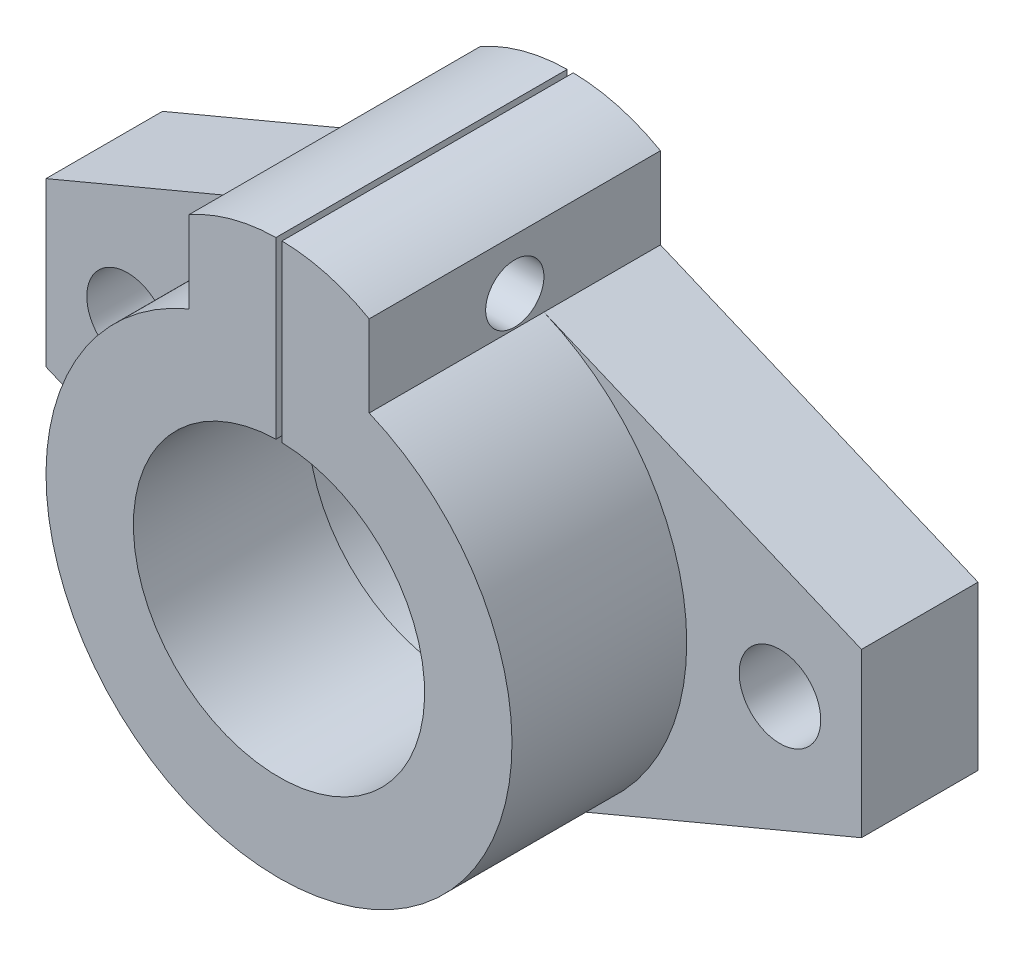
ISO-10303-21;
HEADER;
FILE_DESCRIPTION(('STEP AP214'),'2;1');
FILE_NAME('part.step','',(''),(''),'','','');
FILE_SCHEMA(('AUTOMOTIVE_DESIGN { 1 0 10303 214 1 1 1 1 }'));
ENDSEC;
DATA;
#1=APPLICATION_CONTEXT('core data for automotive mechanical design processes');
#2=APPLICATION_PROTOCOL_DEFINITION('international standard','automotive_design',2000,#1);
#3=PRODUCT_CONTEXT('',#1,'mechanical');
#4=PRODUCT('Part','Part','',(#3));
#5=PRODUCT_RELATED_PRODUCT_CATEGORY('part','',(#4));
#6=PRODUCT_DEFINITION_FORMATION('','',#4);
#7=PRODUCT_DEFINITION_CONTEXT('part definition',#1,'design');
#8=PRODUCT_DEFINITION('design','',#6,#7);
#9=PRODUCT_DEFINITION_SHAPE('','',#8);
#10=(LENGTH_UNIT() NAMED_UNIT(*) SI_UNIT(.MILLI.,.METRE.));
#11=(NAMED_UNIT(*) PLANE_ANGLE_UNIT() SI_UNIT($,.RADIAN.));
#12=(NAMED_UNIT(*) SI_UNIT($,.STERADIAN.) SOLID_ANGLE_UNIT());
#13=UNCERTAINTY_MEASURE_WITH_UNIT(LENGTH_MEASURE(1.E-05),#10,'distance_accuracy_value','');
#14=(GEOMETRIC_REPRESENTATION_CONTEXT(3) GLOBAL_UNCERTAINTY_ASSIGNED_CONTEXT((#13)) GLOBAL_UNIT_ASSIGNED_CONTEXT((#10,
#11,#12)) REPRESENTATION_CONTEXT('',''));
#15=CARTESIAN_POINT('',(0.,0.,0.));
#16=DIRECTION('',(0.,0.,1.));
#17=DIRECTION('',(1.,0.,0.));
#18=AXIS2_PLACEMENT_3D('',#15,#16,#17);
#19=CARTESIAN_POINT('',(0.,11.87489743787,10.));
#20=DIRECTION('',(0.,0.,-1.));
#21=DIRECTION('',(-1.,0.,0.));
#22=AXIS2_PLACEMENT_3D('',#19,#20,#21);
#23=CYLINDRICAL_SURFACE('',#22,15.6193467136848);
#24=DIRECTION('',(0.,0.,-1.));
#25=VECTOR('',#24,1.);
#26=CARTESIAN_POINT('',(-0.258597553957538,27.4921033040735,10.));
#27=LINE('',#26,#25);
#28=CARTESIAN_POINT('',(-0.258597553957538,27.4921033040735,0.));
#29=VERTEX_POINT('',#28);
#30=CARTESIAN_POINT('',(-0.258597553957538,27.4921033040735,25.));
#31=VERTEX_POINT('',#30);
#32=EDGE_CURVE('E179',#29,#31,#27,.F.);
#33=ORIENTED_EDGE('',*,*,#32,.F.);
#34=CARTESIAN_POINT('',(0.,11.87489743787,0.));
#35=DIRECTION('',(0.,0.,1.));
#36=DIRECTION('',(1.,0.,0.));
#37=AXIS2_PLACEMENT_3D('',#34,#35,#36);
#38=CIRCLE('',#37,15.6193467136848);
#39=CARTESIAN_POINT('',(-7.74027571439312,25.441478570472,0.));
#40=VERTEX_POINT('',#39);
#41=EDGE_CURVE('E276',#40,#29,#38,.F.);
#42=ORIENTED_EDGE('',*,*,#41,.F.);
#43=DIRECTION('',(0.,0.,-1.));
#44=VECTOR('',#43,1.);
#45=CARTESIAN_POINT('',(-7.74027571439312,25.441478570472,10.));
#46=LINE('',#45,#44);
#47=CARTESIAN_POINT('',(-7.74027571439312,25.441478570472,25.));
#48=VERTEX_POINT('',#47);
#49=EDGE_CURVE('E246',#48,#40,#46,.T.);
#50=ORIENTED_EDGE('',*,*,#49,.F.);
#51=CARTESIAN_POINT('',(0.,11.8748974378699,25.));
#52=DIRECTION('',(0.,0.,1.));
#53=DIRECTION('',(-1.,0.,0.));
#54=AXIS2_PLACEMENT_3D('',#51,#52,#53);
#55=CIRCLE('',#54,15.6193467136848);
#56=EDGE_CURVE('E188',#31,#48,#55,.T.);
#57=ORIENTED_EDGE('',*,*,#56,.F.);
#58=EDGE_LOOP('',(#33,#42,#50,#57));
#59=FACE_BOUND('',#58,.T.);
#60=ADVANCED_FACE('F36',(#59),#23,.T.);
#61=CARTESIAN_POINT('',(0.,0.,10.));
#62=DIRECTION('',(0.,0.,1.));
#63=DIRECTION('',(1.,0.,0.));
#64=AXIS2_PLACEMENT_3D('',#61,#62,#63);
#65=PLANE('',#64);
#66=CARTESIAN_POINT('',(0.,0.,10.));
#67=DIRECTION('',(0.,0.,1.));
#68=DIRECTION('',(1.,0.,0.));
#69=AXIS2_PLACEMENT_3D('',#66,#67,#68);
#70=CIRCLE('',#69,20.);
#71=CARTESIAN_POINT('',(-7.74027571439312,18.441478570472,10.));
#72=VERTEX_POINT('',#71);
#73=CARTESIAN_POINT('',(-7.74027571439311,-18.441478570472,10.));
#74=VERTEX_POINT('',#73);
#75=EDGE_CURVE('E173',#72,#74,#70,.T.);
#76=ORIENTED_EDGE('',*,*,#75,.F.);
#77=DIRECTION('',(0.922073928523597,0.387013785719656,0.));
#78=VECTOR('',#77,1.);
#79=CARTESIAN_POINT('',(-7.74027571439313,18.441478570472,10.));
#80=LINE('',#79,#78);
#81=CARTESIAN_POINT('',(-35.0000000000568,7.00000000013542,10.));
#82=VERTEX_POINT('',#81);
#83=EDGE_CURVE('E316',#82,#72,#80,.T.);
#84=ORIENTED_EDGE('',*,*,#83,.F.);
#85=DIRECTION('',(0.,1.,0.));
#86=VECTOR('',#85,1.);
#87=CARTESIAN_POINT('',(-35.0000000000568,0.,10.));
#88=LINE('',#87,#86);
#89=CARTESIAN_POINT('',(-35.0000000000568,-7.00000000013543,10.));
#90=VERTEX_POINT('',#89);
#91=EDGE_CURVE('E224',#90,#82,#88,.T.);
#92=ORIENTED_EDGE('',*,*,#91,.F.);
#93=DIRECTION('',(0.922073928523598,-0.387013785719656,0.));
#94=VECTOR('',#93,1.);
#95=CARTESIAN_POINT('',(-7.74027571439311,-18.441478570472,10.));
#96=LINE('',#95,#94);
#97=EDGE_CURVE('E220',#90,#74,#96,.T.);
#98=ORIENTED_EDGE('',*,*,#97,.T.);
#99=EDGE_LOOP('',(#76,#84,#92,#98));
#100=FACE_BOUND('',#99,.T.);
#101=CARTESIAN_POINT('',(-28.,0.,10.));
#102=DIRECTION('',(0.,0.,1.));
#103=DIRECTION('',(1.,0.,0.));
#104=AXIS2_PLACEMENT_3D('',#101,#102,#103);
#105=CIRCLE('',#104,3.5);
#106=CARTESIAN_POINT('',(-24.5,0.,10.));
#107=VERTEX_POINT('',#106);
#108=EDGE_CURVE('E274',#107,#107,#105,.T.);
#109=ORIENTED_EDGE('',*,*,#108,.F.);
#110=EDGE_LOOP('',(#109));
#111=FACE_BOUND('',#110,.T.);
#112=ADVANCED_FACE('F394',(#100,#111),#65,.T.);
#113=CARTESIAN_POINT('',(7.74027571439313,18.441478570472,10.));
#114=DIRECTION('',(-0.387013785719656,-0.922073928523597,0.));
#115=DIRECTION('',(0.922073928523597,-0.387013785719656,0.));
#116=AXIS2_PLACEMENT_3D('',#113,#114,#115);
#117=PLANE('',#116);
#118=DIRECTION('',(-0.922073928523597,0.387013785719656,0.));
#119=VECTOR('',#118,1.);
#120=CARTESIAN_POINT('',(7.74027571439313,18.441478570472,0.));
#121=LINE('',#120,#119);
#122=CARTESIAN_POINT('',(35.0000000000568,7.00000000013542,0.));
#123=VERTEX_POINT('',#122);
#124=CARTESIAN_POINT('',(7.74027571439312,18.441478570472,0.));
#125=VERTEX_POINT('',#124);
#126=EDGE_CURVE('E263',#123,#125,#121,.T.);
#127=ORIENTED_EDGE('',*,*,#126,.T.);
#128=DIRECTION('',(0.,0.,-1.));
#129=VECTOR('',#128,1.);
#130=CARTESIAN_POINT('',(7.74027571439312,18.441478570472,10.));
#131=LINE('',#130,#129);
#132=CARTESIAN_POINT('',(7.74027571439312,18.441478570472,10.));
#133=VERTEX_POINT('',#132);
#134=EDGE_CURVE('E205',#133,#125,#131,.T.);
#135=ORIENTED_EDGE('',*,*,#134,.F.);
#136=DIRECTION('',(-0.922073928523597,0.387013785719656,0.));
#137=VECTOR('',#136,1.);
#138=CARTESIAN_POINT('',(7.74027571439313,18.441478570472,10.));
#139=LINE('',#138,#137);
#140=CARTESIAN_POINT('',(35.0000000000568,7.00000000013542,10.));
#141=VERTEX_POINT('',#140);
#142=EDGE_CURVE('E200',#141,#133,#139,.T.);
#143=ORIENTED_EDGE('',*,*,#142,.F.);
#144=DIRECTION('',(0.,0.,-1.));
#145=VECTOR('',#144,1.);
#146=CARTESIAN_POINT('',(35.0000000000568,7.00000000013542,10.));
#147=LINE('',#146,#145);
#148=EDGE_CURVE('E265',#141,#123,#147,.T.);
#149=ORIENTED_EDGE('',*,*,#148,.T.);
#150=EDGE_LOOP('',(#127,#135,#143,#149));
#151=FACE_BOUND('',#150,.T.);
#152=ADVANCED_FACE('F38',(#151),#117,.F.);
#153=CARTESIAN_POINT('',(7.74027571439312,0.,10.));
#154=DIRECTION('',(-1.,0.,0.));
#155=DIRECTION('',(0.,0.,1.));
#156=AXIS2_PLACEMENT_3D('',#153,#154,#155);
#157=PLANE('',#156);
#158=CARTESIAN_POINT('',(7.74027571439312,21.0864235760214,12.5));
#159=DIRECTION('',(1.,0.,0.));
#160=DIRECTION('',(0.,0.,-1.));
#161=AXIS2_PLACEMENT_3D('',#158,#159,#160);
#162=CIRCLE('',#161,2.5);
#163=CARTESIAN_POINT('',(7.74027571439312,21.0864235760214,10.));
#164=VERTEX_POINT('',#163);
#165=EDGE_CURVE('E374',#164,#164,#162,.T.);
#166=ORIENTED_EDGE('',*,*,#165,.F.);
#167=EDGE_LOOP('',(#166));
#168=FACE_BOUND('',#167,.T.);
#169=DIRECTION('',(0.,1.,0.));
#170=VECTOR('',#169,1.);
#171=CARTESIAN_POINT('',(7.74027571439312,0.,0.));
#172=LINE('',#171,#170);
#173=CARTESIAN_POINT('',(7.74027571439312,25.441478570472,0.));
#174=VERTEX_POINT('',#173);
#175=EDGE_CURVE('E256',#125,#174,#172,.T.);
#176=ORIENTED_EDGE('',*,*,#175,.T.);
#177=DIRECTION('',(0.,0.,-1.));
#178=VECTOR('',#177,1.);
#179=CARTESIAN_POINT('',(7.74027571439312,25.441478570472,10.));
#180=LINE('',#179,#178);
#181=CARTESIAN_POINT('',(7.74027571439312,25.441478570472,25.));
#182=VERTEX_POINT('',#181);
#183=EDGE_CURVE('E247',#182,#174,#180,.T.);
#184=ORIENTED_EDGE('',*,*,#183,.F.);
#185=DIRECTION('',(0.,1.,0.));
#186=VECTOR('',#185,1.);
#187=CARTESIAN_POINT('',(7.74027571439312,18.441478570472,25.));
#188=LINE('',#187,#186);
#189=CARTESIAN_POINT('',(7.74027571439312,18.441478570472,25.));
#190=VERTEX_POINT('',#189);
#191=EDGE_CURVE('E186',#190,#182,#188,.T.);
#192=ORIENTED_EDGE('',*,*,#191,.F.);
#193=DIRECTION('',(0.,0.,-1.));
#194=VECTOR('',#193,1.);
#195=CARTESIAN_POINT('',(7.74027571439312,18.441478570472,25.));
#196=LINE('',#195,#194);
#197=EDGE_CURVE('E195',#190,#133,#196,.T.);
#198=ORIENTED_EDGE('',*,*,#197,.T.);
#199=ORIENTED_EDGE('',*,*,#134,.T.);
#200=EDGE_LOOP('',(#176,#184,#192,#198,#199));
#201=FACE_BOUND('',#200,.T.);
#202=ADVANCED_FACE('F255',(#168,#201),#157,.F.);
#203=DIRECTION('',(0.,0.,-1.));
#204=VECTOR('',#203,1.);
#205=CARTESIAN_POINT('',(0.258597553957538,27.4921033040735,10.));
#206=LINE('',#205,#204);
#207=CARTESIAN_POINT('',(0.258597553957538,27.4921033040735,25.));
#208=VERTEX_POINT('',#207);
#209=CARTESIAN_POINT('',(0.258597553957538,27.4921033040735,0.));
#210=VERTEX_POINT('',#209);
#211=EDGE_CURVE('E360',#208,#210,#206,.T.);
#212=ORIENTED_EDGE('',*,*,#211,.F.);
#213=EDGE_CURVE('E169',#182,#208,#55,.T.);
#214=ORIENTED_EDGE('',*,*,#213,.F.);
#215=ORIENTED_EDGE('',*,*,#183,.T.);
#216=EDGE_CURVE('E269',#210,#174,#38,.F.);
#217=ORIENTED_EDGE('',*,*,#216,.F.);
#218=EDGE_LOOP('',(#212,#214,#215,#217));
#219=FACE_BOUND('',#218,.T.);
#220=ADVANCED_FACE('F396',(#219),#23,.T.);
#221=CARTESIAN_POINT('',(-7.74027571439312,0.,10.));
#222=DIRECTION('',(-1.,0.,0.));
#223=DIRECTION('',(0.,0.,1.));
#224=AXIS2_PLACEMENT_3D('',#221,#222,#223);
#225=PLANE('',#224);
#226=CARTESIAN_POINT('',(-7.74027571439312,21.0864235760214,12.5));
#227=DIRECTION('',(-1.,0.,0.));
#228=DIRECTION('',(0.,0.,1.));
#229=AXIS2_PLACEMENT_3D('',#226,#227,#228);
#230=CIRCLE('',#229,2.5);
#231=CARTESIAN_POINT('',(-7.74027571439312,21.0864235760214,15.));
#232=VERTEX_POINT('',#231);
#233=EDGE_CURVE('E170',#232,#232,#230,.T.);
#234=ORIENTED_EDGE('',*,*,#233,.F.);
#235=EDGE_LOOP('',(#234));
#236=FACE_BOUND('',#235,.T.);
#237=DIRECTION('',(0.,1.,0.));
#238=VECTOR('',#237,1.);
#239=CARTESIAN_POINT('',(-7.74027571439312,0.,0.));
#240=LINE('',#239,#238);
#241=CARTESIAN_POINT('',(-7.74027571439312,18.441478570472,0.));
#242=VERTEX_POINT('',#241);
#243=EDGE_CURVE('E279',#242,#40,#240,.T.);
#244=ORIENTED_EDGE('',*,*,#243,.F.);
#245=DIRECTION('',(0.,0.,-1.));
#246=VECTOR('',#245,1.);
#247=CARTESIAN_POINT('',(-7.74027571439312,18.441478570472,10.));
#248=LINE('',#247,#246);
#249=EDGE_CURVE('E240',#72,#242,#248,.T.);
#250=ORIENTED_EDGE('',*,*,#249,.F.);
#251=DIRECTION('',(0.,0.,-1.));
#252=VECTOR('',#251,1.);
#253=CARTESIAN_POINT('',(-7.74027571439312,18.441478570472,25.));
#254=LINE('',#253,#252);
#255=CARTESIAN_POINT('',(-7.74027571439312,18.441478570472,25.));
#256=VERTEX_POINT('',#255);
#257=EDGE_CURVE('E192',#256,#72,#254,.T.);
#258=ORIENTED_EDGE('',*,*,#257,.F.);
#259=DIRECTION('',(0.,-1.,0.));
#260=VECTOR('',#259,1.);
#261=CARTESIAN_POINT('',(-7.74027571439312,18.441478570472,25.));
#262=LINE('',#261,#260);
#263=EDGE_CURVE('E190',#48,#256,#262,.T.);
#264=ORIENTED_EDGE('',*,*,#263,.F.);
#265=ORIENTED_EDGE('',*,*,#49,.T.);
#266=EDGE_LOOP('',(#244,#250,#258,#264,#265));
#267=FACE_BOUND('',#266,.T.);
#268=ADVANCED_FACE('F345',(#236,#267),#225,.T.);
#269=CARTESIAN_POINT('',(-7.74027571439313,18.441478570472,10.));
#270=DIRECTION('',(-0.387013785719656,0.922073928523597,0.));
#271=DIRECTION('',(-0.922073928523597,-0.387013785719656,0.));
#272=AXIS2_PLACEMENT_3D('',#269,#270,#271);
#273=PLANE('',#272);
#274=DIRECTION('',(0.922073928523597,0.387013785719656,0.));
#275=VECTOR('',#274,1.);
#276=CARTESIAN_POINT('',(-7.74027571439313,18.441478570472,0.));
#277=LINE('',#276,#275);
#278=CARTESIAN_POINT('',(-35.0000000000568,7.00000000013542,0.));
#279=VERTEX_POINT('',#278);
#280=EDGE_CURVE('E282',#279,#242,#277,.T.);
#281=ORIENTED_EDGE('',*,*,#280,.F.);
#282=DIRECTION('',(0.,0.,-1.));
#283=VECTOR('',#282,1.);
#284=CARTESIAN_POINT('',(-35.0000000000568,7.00000000013542,10.));
#285=LINE('',#284,#283);
#286=EDGE_CURVE('E235',#82,#279,#285,.T.);
#287=ORIENTED_EDGE('',*,*,#286,.F.);
#288=ORIENTED_EDGE('',*,*,#83,.T.);
#289=ORIENTED_EDGE('',*,*,#249,.T.);
#290=EDGE_LOOP('',(#281,#287,#288,#289));
#291=FACE_BOUND('',#290,.T.);
#292=ADVANCED_FACE('F339',(#291),#273,.T.);
#293=CARTESIAN_POINT('',(-35.0000000000568,0.,10.));
#294=DIRECTION('',(-1.,0.,0.));
#295=DIRECTION('',(0.,0.,1.));
#296=AXIS2_PLACEMENT_3D('',#293,#294,#295);
#297=PLANE('',#296);
#298=DIRECTION('',(0.,1.,0.));
#299=VECTOR('',#298,1.);
#300=CARTESIAN_POINT('',(-35.0000000000568,0.,0.));
#301=LINE('',#300,#299);
#302=CARTESIAN_POINT('',(-35.0000000000568,-7.00000000013543,0.));
#303=VERTEX_POINT('',#302);
#304=EDGE_CURVE('E285',#303,#279,#301,.T.);
#305=ORIENTED_EDGE('',*,*,#304,.F.);
#306=DIRECTION('',(0.,0.,-1.));
#307=VECTOR('',#306,1.);
#308=CARTESIAN_POINT('',(-35.0000000000568,-7.00000000013543,10.));
#309=LINE('',#308,#307);
#310=EDGE_CURVE('E229',#90,#303,#309,.T.);
#311=ORIENTED_EDGE('',*,*,#310,.F.);
#312=ORIENTED_EDGE('',*,*,#91,.T.);
#313=ORIENTED_EDGE('',*,*,#286,.T.);
#314=EDGE_LOOP('',(#305,#311,#312,#313));
#315=FACE_BOUND('',#314,.T.);
#316=ADVANCED_FACE('F336',(#315),#297,.T.);
#317=CARTESIAN_POINT('',(-7.74027571439311,-18.441478570472,10.));
#318=DIRECTION('',(0.387013785719656,0.922073928523598,0.));
#319=DIRECTION('',(-0.922073928523598,0.387013785719656,0.));
#320=AXIS2_PLACEMENT_3D('',#317,#318,#319);
#321=PLANE('',#320);
#322=DIRECTION('',(0.922073928523598,-0.387013785719656,0.));
#323=VECTOR('',#322,1.);
#324=CARTESIAN_POINT('',(-7.74027571439311,-18.441478570472,0.));
#325=LINE('',#324,#323);
#326=CARTESIAN_POINT('',(-7.74027571439311,-18.441478570472,0.));
#327=VERTEX_POINT('',#326);
#328=EDGE_CURVE('E288',#303,#327,#325,.T.);
#329=ORIENTED_EDGE('',*,*,#328,.T.);
#330=DIRECTION('',(0.,0.,-1.));
#331=VECTOR('',#330,1.);
#332=CARTESIAN_POINT('',(-7.74027571439311,-18.441478570472,10.));
#333=LINE('',#332,#331);
#334=EDGE_CURVE('E212',#74,#327,#333,.T.);
#335=ORIENTED_EDGE('',*,*,#334,.F.);
#336=ORIENTED_EDGE('',*,*,#97,.F.);
#337=ORIENTED_EDGE('',*,*,#310,.T.);
#338=EDGE_LOOP('',(#329,#335,#336,#337));
#339=FACE_BOUND('',#338,.T.);
#340=ADVANCED_FACE('F445',(#339),#321,.F.);
#341=CARTESIAN_POINT('',(0.,0.,10.));
#342=DIRECTION('',(0.,0.,-1.));
#343=DIRECTION('',(-1.,0.,0.));
#344=AXIS2_PLACEMENT_3D('',#341,#342,#343);
#345=CYLINDRICAL_SURFACE('',#344,20.);
#346=CARTESIAN_POINT('',(0.,0.,0.));
#347=DIRECTION('',(0.,0.,1.));
#348=DIRECTION('',(1.,0.,0.));
#349=AXIS2_PLACEMENT_3D('',#346,#347,#348);
#350=CIRCLE('',#349,20.);
#351=CARTESIAN_POINT('',(7.74027571439311,-18.441478570472,0.));
#352=VERTEX_POINT('',#351);
#353=EDGE_CURVE('E290',#327,#352,#350,.T.);
#354=ORIENTED_EDGE('',*,*,#353,.T.);
#355=DIRECTION('',(0.,0.,-1.));
#356=VECTOR('',#355,1.);
#357=CARTESIAN_POINT('',(7.74027571439311,-18.441478570472,10.));
#358=LINE('',#357,#356);
#359=CARTESIAN_POINT('',(7.74027571439311,-18.441478570472,10.));
#360=VERTEX_POINT('',#359);
#361=EDGE_CURVE('E210',#360,#352,#358,.T.);
#362=ORIENTED_EDGE('',*,*,#361,.F.);
#363=EDGE_CURVE('E160',#360,#133,#70,.T.);
#364=ORIENTED_EDGE('',*,*,#363,.T.);
#365=ORIENTED_EDGE('',*,*,#197,.F.);
#366=CARTESIAN_POINT('',(0.,0.,25.));
#367=DIRECTION('',(0.,0.,1.));
#368=DIRECTION('',(1.,0.,0.));
#369=AXIS2_PLACEMENT_3D('',#366,#367,#368);
#370=CIRCLE('',#369,20.);
#371=EDGE_CURVE('E177',#256,#190,#370,.T.);
#372=ORIENTED_EDGE('',*,*,#371,.F.);
#373=ORIENTED_EDGE('',*,*,#257,.T.);
#374=ORIENTED_EDGE('',*,*,#75,.T.);
#375=ORIENTED_EDGE('',*,*,#334,.T.);
#376=EDGE_LOOP('',(#354,#362,#364,#365,#372,#373,#374,#375));
#377=FACE_BOUND('',#376,.T.);
#378=ADVANCED_FACE('F325',(#377),#345,.T.);
#379=CARTESIAN_POINT('',(7.74027571439311,-18.441478570472,10.));
#380=DIRECTION('',(0.387013785719656,-0.922073928523598,0.));
#381=DIRECTION('',(0.922073928523598,0.387013785719656,0.));
#382=AXIS2_PLACEMENT_3D('',#379,#380,#381);
#383=PLANE('',#382);
#384=DIRECTION('',(-0.922073928523598,-0.387013785719656,0.));
#385=VECTOR('',#384,1.);
#386=CARTESIAN_POINT('',(7.74027571439311,-18.441478570472,0.));
#387=LINE('',#386,#385);
#388=CARTESIAN_POINT('',(35.0000000000568,-7.00000000013543,0.));
#389=VERTEX_POINT('',#388);
#390=EDGE_CURVE('E292',#389,#352,#387,.T.);
#391=ORIENTED_EDGE('',*,*,#390,.F.);
#392=DIRECTION('',(0.,0.,-1.));
#393=VECTOR('',#392,1.);
#394=CARTESIAN_POINT('',(35.0000000000568,-7.00000000013543,10.));
#395=LINE('',#394,#393);
#396=CARTESIAN_POINT('',(35.0000000000568,-7.00000000013543,10.));
#397=VERTEX_POINT('',#396);
#398=EDGE_CURVE('E213',#397,#389,#395,.T.);
#399=ORIENTED_EDGE('',*,*,#398,.F.);
#400=DIRECTION('',(-0.922073928523598,-0.387013785719656,0.));
#401=VECTOR('',#400,1.);
#402=CARTESIAN_POINT('',(7.74027571439311,-18.441478570472,10.));
#403=LINE('',#402,#401);
#404=EDGE_CURVE('E216',#397,#360,#403,.T.);
#405=ORIENTED_EDGE('',*,*,#404,.T.);
#406=ORIENTED_EDGE('',*,*,#361,.T.);
#407=EDGE_LOOP('',(#391,#399,#405,#406));
#408=FACE_BOUND('',#407,.T.);
#409=ADVANCED_FACE('F329',(#408),#383,.T.);
#410=CARTESIAN_POINT('',(0.,0.,10.));
#411=DIRECTION('',(0.,0.,-1.));
#412=DIRECTION('',(-1.,0.,0.));
#413=AXIS2_PLACEMENT_3D('',#410,#411,#412);
#414=CYLINDRICAL_SURFACE('',#413,13.);
#415=DIRECTION('',(0.,0.,-1.));
#416=VECTOR('',#415,1.);
#417=CARTESIAN_POINT('',(-0.258597553957538,12.9974277187868,10.));
#418=LINE('',#417,#416);
#419=CARTESIAN_POINT('',(-0.258597553957538,12.9974277187868,10.));
#420=VERTEX_POINT('',#419);
#421=CARTESIAN_POINT('',(-0.258597553957538,12.9974277187868,0.));
#422=VERTEX_POINT('',#421);
#423=EDGE_CURVE('E353',#420,#422,#418,.T.);
#424=ORIENTED_EDGE('',*,*,#423,.F.);
#425=CARTESIAN_POINT('',(0.,0.,10.));
#426=DIRECTION('',(0.,0.,1.));
#427=DIRECTION('',(1.,0.,0.));
#428=AXIS2_PLACEMENT_3D('',#425,#426,#427);
#429=CIRCLE('',#428,13.);
#430=CARTESIAN_POINT('',(0.258597553957538,12.9974277187868,10.));
#431=VERTEX_POINT('',#430);
#432=EDGE_CURVE('E197',#420,#431,#429,.T.);
#433=ORIENTED_EDGE('',*,*,#432,.T.);
#434=DIRECTION('',(0.,0.,-1.));
#435=VECTOR('',#434,1.);
#436=CARTESIAN_POINT('',(0.258597553957538,12.9974277187868,10.));
#437=LINE('',#436,#435);
#438=CARTESIAN_POINT('',(0.258597553957538,12.9974277187868,0.));
#439=VERTEX_POINT('',#438);
#440=EDGE_CURVE('E365',#439,#431,#437,.F.);
#441=ORIENTED_EDGE('',*,*,#440,.F.);
#442=CARTESIAN_POINT('',(0.,0.,0.));
#443=DIRECTION('',(0.,0.,1.));
#444=DIRECTION('',(1.,0.,0.));
#445=AXIS2_PLACEMENT_3D('',#442,#443,#444);
#446=CIRCLE('',#445,13.);
#447=EDGE_CURVE('E300',#422,#439,#446,.T.);
#448=ORIENTED_EDGE('',*,*,#447,.F.);
#449=EDGE_LOOP('',(#424,#433,#441,#448));
#450=FACE_BOUND('',#449,.T.);
#451=ADVANCED_FACE('F413',(#450),#414,.F.);
#452=CARTESIAN_POINT('',(28.,0.,10.));
#453=DIRECTION('',(0.,0.,-1.));
#454=DIRECTION('',(-1.,0.,0.));
#455=AXIS2_PLACEMENT_3D('',#452,#453,#454);
#456=CYLINDRICAL_SURFACE('',#455,3.5);
#457=CARTESIAN_POINT('',(28.,0.,10.));
#458=DIRECTION('',(0.,0.,1.));
#459=DIRECTION('',(1.,0.,0.));
#460=AXIS2_PLACEMENT_3D('',#457,#458,#459);
#461=CIRCLE('',#460,3.5);
#462=CARTESIAN_POINT('',(31.5,0.,10.));
#463=VERTEX_POINT('',#462);
#464=EDGE_CURVE('E306',#463,#463,#461,.F.);
#465=ORIENTED_EDGE('',*,*,#464,.F.);
#466=EDGE_LOOP('',(#465));
#467=FACE_BOUND('',#466,.T.);
#468=CARTESIAN_POINT('',(28.,0.,0.));
#469=DIRECTION('',(0.,0.,1.));
#470=DIRECTION('',(1.,0.,0.));
#471=AXIS2_PLACEMENT_3D('',#468,#469,#470);
#472=CIRCLE('',#471,3.5);
#473=CARTESIAN_POINT('',(31.5,0.,0.));
#474=VERTEX_POINT('',#473);
#475=EDGE_CURVE('E297',#474,#474,#472,.F.);
#476=ORIENTED_EDGE('',*,*,#475,.T.);
#477=EDGE_LOOP('',(#476));
#478=FACE_BOUND('',#477,.T.);
#479=ADVANCED_FACE('F435',(#467,#478),#456,.F.);
#480=CARTESIAN_POINT('',(35.0000000000568,0.,10.));
#481=DIRECTION('',(-1.,0.,0.));
#482=DIRECTION('',(0.,0.,1.));
#483=AXIS2_PLACEMENT_3D('',#480,#481,#482);
#484=PLANE('',#483);
#485=DIRECTION('',(0.,1.,0.));
#486=VECTOR('',#485,1.);
#487=CARTESIAN_POINT('',(35.0000000000568,0.,0.));
#488=LINE('',#487,#486);
#489=EDGE_CURVE('E295',#389,#123,#488,.T.);
#490=ORIENTED_EDGE('',*,*,#489,.T.);
#491=ORIENTED_EDGE('',*,*,#148,.F.);
#492=DIRECTION('',(0.,1.,0.));
#493=VECTOR('',#492,1.);
#494=CARTESIAN_POINT('',(35.0000000000568,0.,10.));
#495=LINE('',#494,#493);
#496=EDGE_CURVE('E219',#397,#141,#495,.T.);
#497=ORIENTED_EDGE('',*,*,#496,.F.);
#498=ORIENTED_EDGE('',*,*,#398,.T.);
#499=EDGE_LOOP('',(#490,#491,#497,#498));
#500=FACE_BOUND('',#499,.T.);
#501=ADVANCED_FACE('F331',(#500),#484,.F.);
#502=CARTESIAN_POINT('',(-28.,0.,10.));
#503=DIRECTION('',(0.,0.,-1.));
#504=DIRECTION('',(-1.,0.,0.));
#505=AXIS2_PLACEMENT_3D('',#502,#503,#504);
#506=CYLINDRICAL_SURFACE('',#505,3.5);
#507=ORIENTED_EDGE('',*,*,#108,.T.);
#508=EDGE_LOOP('',(#507));
#509=FACE_BOUND('',#508,.T.);
#510=CARTESIAN_POINT('',(-28.,0.,0.));
#511=DIRECTION('',(0.,0.,1.));
#512=DIRECTION('',(1.,0.,0.));
#513=AXIS2_PLACEMENT_3D('',#510,#511,#512);
#514=CIRCLE('',#513,3.5);
#515=CARTESIAN_POINT('',(-24.5,0.,0.));
#516=VERTEX_POINT('',#515);
#517=EDGE_CURVE('E303',#516,#516,#514,.T.);
#518=ORIENTED_EDGE('',*,*,#517,.F.);
#519=EDGE_LOOP('',(#518));
#520=FACE_BOUND('',#519,.T.);
#521=ADVANCED_FACE('F427',(#509,#520),#506,.F.);
#522=ORIENTED_EDGE('',*,*,#363,.F.);
#523=ORIENTED_EDGE('',*,*,#404,.F.);
#524=ORIENTED_EDGE('',*,*,#496,.T.);
#525=ORIENTED_EDGE('',*,*,#142,.T.);
#526=EDGE_LOOP('',(#522,#523,#524,#525));
#527=FACE_BOUND('',#526,.T.);
#528=ORIENTED_EDGE('',*,*,#464,.T.);
#529=EDGE_LOOP('',(#528));
#530=FACE_BOUND('',#529,.T.);
#531=ADVANCED_FACE('F321',(#527,#530),#65,.T.);
#532=CARTESIAN_POINT('',(0.,0.,0.));
#533=DIRECTION('',(0.,0.,1.));
#534=DIRECTION('',(1.,0.,0.));
#535=AXIS2_PLACEMENT_3D('',#532,#533,#534);
#536=PLANE('',#535);
#537=ORIENTED_EDGE('',*,*,#475,.F.);
#538=EDGE_LOOP('',(#537));
#539=FACE_BOUND('',#538,.T.);
#540=ORIENTED_EDGE('',*,*,#41,.T.);
#541=DIRECTION('',(0.,-1.,0.));
#542=VECTOR('',#541,1.);
#543=CARTESIAN_POINT('',(-0.258597553957538,0.,0.));
#544=LINE('',#543,#542);
#545=EDGE_CURVE('E352',#29,#422,#544,.T.);
#546=ORIENTED_EDGE('',*,*,#545,.T.);
#547=ORIENTED_EDGE('',*,*,#447,.T.);
#548=DIRECTION('',(0.,1.,0.));
#549=VECTOR('',#548,1.);
#550=CARTESIAN_POINT('',(0.258597553957538,0.,0.));
#551=LINE('',#550,#549);
#552=EDGE_CURVE('E362',#439,#210,#551,.T.);
#553=ORIENTED_EDGE('',*,*,#552,.T.);
#554=ORIENTED_EDGE('',*,*,#216,.T.);
#555=ORIENTED_EDGE('',*,*,#175,.F.);
#556=ORIENTED_EDGE('',*,*,#126,.F.);
#557=ORIENTED_EDGE('',*,*,#489,.F.);
#558=ORIENTED_EDGE('',*,*,#390,.T.);
#559=ORIENTED_EDGE('',*,*,#353,.F.);
#560=ORIENTED_EDGE('',*,*,#328,.F.);
#561=ORIENTED_EDGE('',*,*,#304,.T.);
#562=ORIENTED_EDGE('',*,*,#280,.T.);
#563=ORIENTED_EDGE('',*,*,#243,.T.);
#564=EDGE_LOOP('',(#540,#546,#547,#553,#554,#555,#556,#557,#558,#559,#560,#561,#562,#563));
#565=FACE_BOUND('',#564,.T.);
#566=ORIENTED_EDGE('',*,*,#517,.T.);
#567=EDGE_LOOP('',(#566));
#568=FACE_BOUND('',#567,.T.);
#569=ADVANCED_FACE('F332',(#539,#565,#568),#536,.F.);
#570=CARTESIAN_POINT('',(0.,0.,25.));
#571=DIRECTION('',(0.,0.,1.));
#572=DIRECTION('',(1.,0.,0.));
#573=AXIS2_PLACEMENT_3D('',#570,#571,#572);
#574=PLANE('',#573);
#575=DIRECTION('',(0.,-1.,0.));
#576=VECTOR('',#575,1.);
#577=CARTESIAN_POINT('',(-0.258597553957538,12.3781063786396,25.));
#578=LINE('',#577,#576);
#579=CARTESIAN_POINT('',(-0.258597553957538,12.497324805937,25.));
#580=VERTEX_POINT('',#579);
#581=EDGE_CURVE('E59',#31,#580,#578,.T.);
#582=ORIENTED_EDGE('',*,*,#581,.F.);
#583=ORIENTED_EDGE('',*,*,#56,.T.);
#584=ORIENTED_EDGE('',*,*,#263,.T.);
#585=ORIENTED_EDGE('',*,*,#371,.T.);
#586=ORIENTED_EDGE('',*,*,#191,.T.);
#587=ORIENTED_EDGE('',*,*,#213,.T.);
#588=DIRECTION('',(0.,1.,0.));
#589=VECTOR('',#588,1.);
#590=CARTESIAN_POINT('',(0.258597553957538,12.3781063786396,25.));
#591=LINE('',#590,#589);
#592=CARTESIAN_POINT('',(0.258597553957538,12.497324805937,25.));
#593=VERTEX_POINT('',#592);
#594=EDGE_CURVE('E154',#593,#208,#591,.T.);
#595=ORIENTED_EDGE('',*,*,#594,.F.);
#596=CARTESIAN_POINT('',(0.,0.,25.));
#597=DIRECTION('',(0.,0.,1.));
#598=DIRECTION('',(1.,0.,0.));
#599=AXIS2_PLACEMENT_3D('',#596,#597,#598);
#600=CIRCLE('',#599,12.5);
#601=EDGE_CURVE('E166',#580,#593,#600,.T.);
#602=ORIENTED_EDGE('',*,*,#601,.F.);
#603=EDGE_LOOP('',(#582,#583,#584,#585,#586,#587,#595,#602));
#604=FACE_BOUND('',#603,.T.);
#605=ADVANCED_FACE('F165',(#604),#574,.T.);
#606=CARTESIAN_POINT('',(0.,0.,10.));
#607=DIRECTION('',(0.,0.,1.));
#608=DIRECTION('',(1.,0.,0.));
#609=AXIS2_PLACEMENT_3D('',#606,#607,#608);
#610=PLANE('',#609);
#611=ORIENTED_EDGE('',*,*,#432,.F.);
#612=DIRECTION('',(0.,-1.,0.));
#613=VECTOR('',#612,1.);
#614=CARTESIAN_POINT('',(-0.258597553957538,0.,10.));
#615=LINE('',#614,#613);
#616=CARTESIAN_POINT('',(-0.258597553957538,12.497324805937,10.));
#617=VERTEX_POINT('',#616);
#618=EDGE_CURVE('E355',#420,#617,#615,.T.);
#619=ORIENTED_EDGE('',*,*,#618,.T.);
#620=CARTESIAN_POINT('',(0.,0.,10.));
#621=DIRECTION('',(0.,0.,1.));
#622=DIRECTION('',(1.,0.,0.));
#623=AXIS2_PLACEMENT_3D('',#620,#621,#622);
#624=CIRCLE('',#623,12.5);
#625=CARTESIAN_POINT('',(0.258597553957538,12.497324805937,10.));
#626=VERTEX_POINT('',#625);
#627=EDGE_CURVE('E174',#617,#626,#624,.T.);
#628=ORIENTED_EDGE('',*,*,#627,.T.);
#629=DIRECTION('',(0.,1.,0.));
#630=VECTOR('',#629,1.);
#631=CARTESIAN_POINT('',(0.258597553957538,0.,10.));
#632=LINE('',#631,#630);
#633=EDGE_CURVE('E52',#626,#431,#632,.T.);
#634=ORIENTED_EDGE('',*,*,#633,.T.);
#635=EDGE_LOOP('',(#611,#619,#628,#634));
#636=FACE_BOUND('',#635,.T.);
#637=ADVANCED_FACE('F416',(#636),#610,.F.);
#638=CARTESIAN_POINT('',(0.,0.,25.));
#639=DIRECTION('',(0.,0.,-1.));
#640=DIRECTION('',(-1.,0.,0.));
#641=AXIS2_PLACEMENT_3D('',#638,#639,#640);
#642=CYLINDRICAL_SURFACE('',#641,12.5);
#643=DIRECTION('',(0.,0.,-1.));
#644=VECTOR('',#643,1.);
#645=CARTESIAN_POINT('',(-0.258597553957538,12.497324805937,25.));
#646=LINE('',#645,#644);
#647=EDGE_CURVE('E11',#580,#617,#646,.T.);
#648=ORIENTED_EDGE('',*,*,#647,.F.);
#649=ORIENTED_EDGE('',*,*,#601,.T.);
#650=DIRECTION('',(0.,0.,-1.));
#651=VECTOR('',#650,1.);
#652=CARTESIAN_POINT('',(0.258597553957538,12.497324805937,25.));
#653=LINE('',#652,#651);
#654=EDGE_CURVE('E45',#626,#593,#653,.F.);
#655=ORIENTED_EDGE('',*,*,#654,.F.);
#656=ORIENTED_EDGE('',*,*,#627,.F.);
#657=EDGE_LOOP('',(#648,#649,#655,#656));
#658=FACE_BOUND('',#657,.T.);
#659=ADVANCED_FACE('F172',(#658),#642,.F.);
#660=CARTESIAN_POINT('',(0.258597553957538,12.3781063786396,-2.50000000007189E-05));
#661=DIRECTION('',(1.,0.,0.));
#662=DIRECTION('',(0.,0.,-1.));
#663=AXIS2_PLACEMENT_3D('',#660,#661,#662);
#664=PLANE('',#663);
#665=CARTESIAN_POINT('',(0.258597553957539,21.0864235760214,12.5));
#666=DIRECTION('',(1.,0.,0.));
#667=DIRECTION('',(0.,0.,-1.));
#668=AXIS2_PLACEMENT_3D('',#665,#666,#667);
#669=CIRCLE('',#668,2.5);
#670=CARTESIAN_POINT('',(0.258597553957539,21.0864235760214,10.));
#671=VERTEX_POINT('',#670);
#672=EDGE_CURVE('E371',#671,#671,#669,.T.);
#673=ORIENTED_EDGE('',*,*,#672,.T.);
#674=EDGE_LOOP('',(#673));
#675=FACE_BOUND('',#674,.T.);
#676=ORIENTED_EDGE('',*,*,#211,.T.);
#677=ORIENTED_EDGE('',*,*,#552,.F.);
#678=ORIENTED_EDGE('',*,*,#440,.T.);
#679=ORIENTED_EDGE('',*,*,#633,.F.);
#680=ORIENTED_EDGE('',*,*,#654,.T.);
#681=ORIENTED_EDGE('',*,*,#594,.T.);
#682=EDGE_LOOP('',(#676,#677,#678,#679,#680,#681));
#683=FACE_BOUND('',#682,.T.);
#684=ADVANCED_FACE('F153',(#675,#683),#664,.F.);
#685=CARTESIAN_POINT('',(-0.258597553957538,12.3781063786396,-2.50000000007189E-05));
#686=DIRECTION('',(-1.,0.,0.));
#687=DIRECTION('',(0.,0.,1.));
#688=AXIS2_PLACEMENT_3D('',#685,#686,#687);
#689=PLANE('',#688);
#690=CARTESIAN_POINT('',(-0.258597553957539,21.0864235760214,12.5));
#691=DIRECTION('',(-1.,0.,0.));
#692=DIRECTION('',(0.,0.,1.));
#693=AXIS2_PLACEMENT_3D('',#690,#691,#692);
#694=CIRCLE('',#693,2.5);
#695=CARTESIAN_POINT('',(-0.258597553957539,21.0864235760214,15.));
#696=VERTEX_POINT('',#695);
#697=EDGE_CURVE('E40',#696,#696,#694,.T.);
#698=ORIENTED_EDGE('',*,*,#697,.T.);
#699=EDGE_LOOP('',(#698));
#700=FACE_BOUND('',#699,.T.);
#701=ORIENTED_EDGE('',*,*,#32,.T.);
#702=ORIENTED_EDGE('',*,*,#581,.T.);
#703=ORIENTED_EDGE('',*,*,#647,.T.);
#704=ORIENTED_EDGE('',*,*,#618,.F.);
#705=ORIENTED_EDGE('',*,*,#423,.T.);
#706=ORIENTED_EDGE('',*,*,#545,.F.);
#707=EDGE_LOOP('',(#701,#702,#703,#704,#705,#706));
#708=FACE_BOUND('',#707,.T.);
#709=ADVANCED_FACE('F381',(#700,#708),#689,.F.);
#710=CARTESIAN_POINT('',(-35.0000250000568,21.0864235760214,12.5));
#711=DIRECTION('',(1.,0.,0.));
#712=DIRECTION('',(0.,0.,-1.));
#713=AXIS2_PLACEMENT_3D('',#710,#711,#712);
#714=CYLINDRICAL_SURFACE('',#713,2.5);
#715=ORIENTED_EDGE('',*,*,#233,.T.);
#716=EDGE_LOOP('',(#715));
#717=FACE_BOUND('',#716,.T.);
#718=ORIENTED_EDGE('',*,*,#697,.F.);
#719=EDGE_LOOP('',(#718));
#720=FACE_BOUND('',#719,.T.);
#721=ADVANCED_FACE('F383',(#717,#720),#714,.F.);
#722=ORIENTED_EDGE('',*,*,#165,.T.);
#723=EDGE_LOOP('',(#722));
#724=FACE_BOUND('',#723,.T.);
#725=ORIENTED_EDGE('',*,*,#672,.F.);
#726=EDGE_LOOP('',(#725));
#727=FACE_BOUND('',#726,.T.);
#728=ADVANCED_FACE('F385',(#724,#727),#714,.F.);
#729=CLOSED_SHELL('',(#60,#112,#152,#202,#220,#268,#292,#316,#340,#378,#409,#451,#479,#501,#521,
#531,#569,#605,#637,#659,#684,#709,#721,#728));
#730=MANIFOLD_SOLID_BREP('B2',#729);
#731=ADVANCED_BREP_SHAPE_REPRESENTATION('',(#18,#730),#14);
#732=SHAPE_DEFINITION_REPRESENTATION(#9,#731);
ENDSEC;
END-ISO-10303-21;
